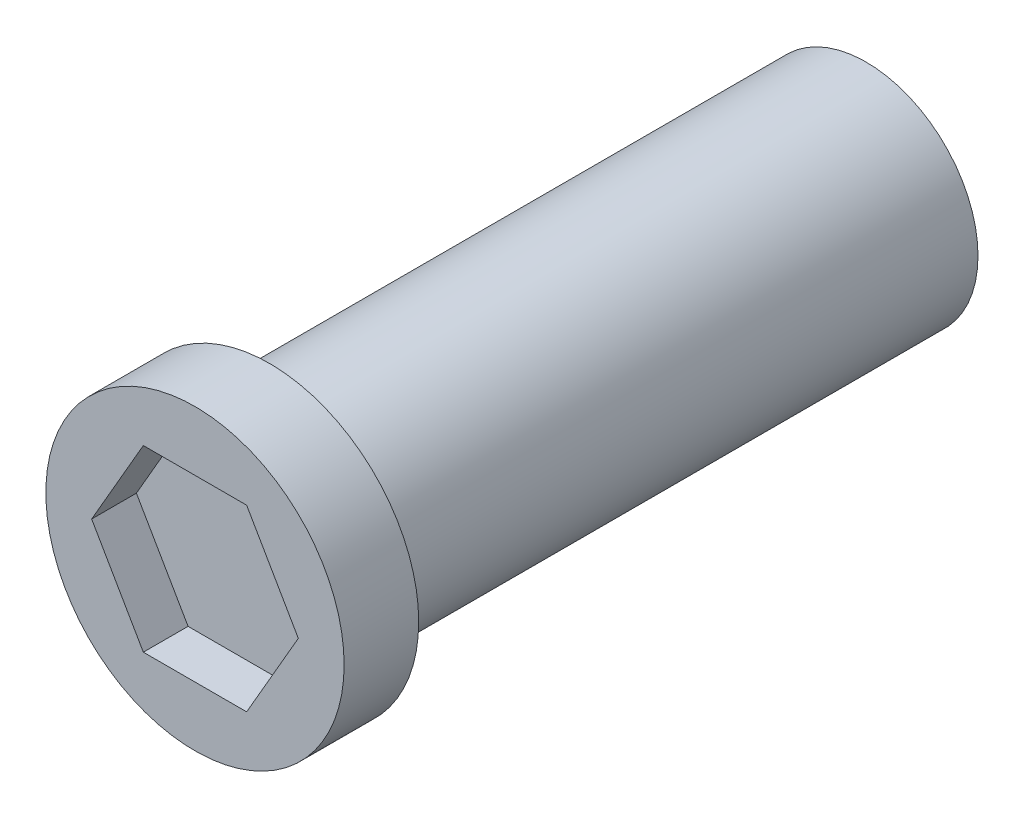
ISO-10303-21;
HEADER;
FILE_DESCRIPTION(('STEP AP214'),'2;1');
FILE_NAME('part.step','',(''),(''),'','','');
FILE_SCHEMA(('AUTOMOTIVE_DESIGN { 1 0 10303 214 1 1 1 1 }'));
ENDSEC;
DATA;
#1=APPLICATION_CONTEXT('core data for automotive mechanical design processes');
#2=APPLICATION_PROTOCOL_DEFINITION('international standard','automotive_design',2000,#1);
#3=PRODUCT_CONTEXT('',#1,'mechanical');
#4=PRODUCT('Part','Part','',(#3));
#5=PRODUCT_RELATED_PRODUCT_CATEGORY('part','',(#4));
#6=PRODUCT_DEFINITION_FORMATION('','',#4);
#7=PRODUCT_DEFINITION_CONTEXT('part definition',#1,'design');
#8=PRODUCT_DEFINITION('design','',#6,#7);
#9=PRODUCT_DEFINITION_SHAPE('','',#8);
#10=(LENGTH_UNIT() NAMED_UNIT(*) SI_UNIT(.MILLI.,.METRE.));
#11=(NAMED_UNIT(*) PLANE_ANGLE_UNIT() SI_UNIT($,.RADIAN.));
#12=(NAMED_UNIT(*) SI_UNIT($,.STERADIAN.) SOLID_ANGLE_UNIT());
#13=UNCERTAINTY_MEASURE_WITH_UNIT(LENGTH_MEASURE(1.E-05),#10,'distance_accuracy_value','');
#14=(GEOMETRIC_REPRESENTATION_CONTEXT(3) GLOBAL_UNCERTAINTY_ASSIGNED_CONTEXT((#13)) GLOBAL_UNIT_ASSIGNED_CONTEXT((#10,
#11,#12)) REPRESENTATION_CONTEXT('',''));
#15=CARTESIAN_POINT('',(0.,0.,0.));
#16=DIRECTION('',(0.,0.,1.));
#17=DIRECTION('',(1.,0.,0.));
#18=AXIS2_PLACEMENT_3D('',#15,#16,#17);
#19=CARTESIAN_POINT('',(0.,0.,40.));
#20=DIRECTION('',(0.,0.,-1.));
#21=DIRECTION('',(-1.,0.,0.));
#22=AXIS2_PLACEMENT_3D('',#19,#20,#21);
#23=CYLINDRICAL_SURFACE('',#22,7.5);
#24=CARTESIAN_POINT('',(0.,0.,40.));
#25=DIRECTION('',(0.,0.,1.));
#26=DIRECTION('',(1.,0.,0.));
#27=AXIS2_PLACEMENT_3D('',#24,#25,#26);
#28=CIRCLE('',#27,7.5);
#29=CARTESIAN_POINT('',(7.5,0.,40.));
#30=VERTEX_POINT('',#29);
#31=EDGE_CURVE('E11',#30,#30,#28,.T.);
#32=ORIENTED_EDGE('',*,*,#31,.F.);
#33=EDGE_LOOP('',(#32));
#34=FACE_BOUND('',#33,.T.);
#35=CARTESIAN_POINT('',(0.,0.,0.));
#36=DIRECTION('',(0.,0.,1.));
#37=DIRECTION('',(1.,0.,0.));
#38=AXIS2_PLACEMENT_3D('',#35,#36,#37);
#39=CIRCLE('',#38,7.5);
#40=CARTESIAN_POINT('',(7.5,0.,0.));
#41=VERTEX_POINT('',#40);
#42=EDGE_CURVE('E46',#41,#41,#39,.T.);
#43=ORIENTED_EDGE('',*,*,#42,.T.);
#44=EDGE_LOOP('',(#43));
#45=FACE_BOUND('',#44,.T.);
#46=ADVANCED_FACE('F43',(#34,#45),#23,.T.);
#47=CARTESIAN_POINT('',(0.,0.,0.));
#48=DIRECTION('',(0.,0.,1.));
#49=DIRECTION('',(1.,0.,0.));
#50=AXIS2_PLACEMENT_3D('',#47,#48,#49);
#51=PLANE('',#50);
#52=ORIENTED_EDGE('',*,*,#42,.F.);
#53=EDGE_LOOP('',(#52));
#54=FACE_BOUND('',#53,.T.);
#55=ADVANCED_FACE('F193',(#54),#51,.F.);
#56=CARTESIAN_POINT('',(0.,0.,45.));
#57=DIRECTION('',(0.,0.,-1.));
#58=DIRECTION('',(-1.,0.,0.));
#59=AXIS2_PLACEMENT_3D('',#56,#57,#58);
#60=CYLINDRICAL_SURFACE('',#59,10.);
#61=CARTESIAN_POINT('',(0.,0.,45.));
#62=DIRECTION('',(0.,0.,1.));
#63=DIRECTION('',(1.,0.,0.));
#64=AXIS2_PLACEMENT_3D('',#61,#62,#63);
#65=CIRCLE('',#64,10.);
#66=CARTESIAN_POINT('',(10.,0.,45.));
#67=VERTEX_POINT('',#66);
#68=EDGE_CURVE('E167',#67,#67,#65,.T.);
#69=ORIENTED_EDGE('',*,*,#68,.F.);
#70=EDGE_LOOP('',(#69));
#71=FACE_BOUND('',#70,.T.);
#72=CARTESIAN_POINT('',(0.,0.,40.));
#73=DIRECTION('',(0.,0.,1.));
#74=DIRECTION('',(1.,0.,0.));
#75=AXIS2_PLACEMENT_3D('',#72,#73,#74);
#76=CIRCLE('',#75,10.);
#77=CARTESIAN_POINT('',(10.,0.,40.));
#78=VERTEX_POINT('',#77);
#79=EDGE_CURVE('E157',#78,#78,#76,.T.);
#80=ORIENTED_EDGE('',*,*,#79,.T.);
#81=EDGE_LOOP('',(#80));
#82=FACE_BOUND('',#81,.T.);
#83=ADVANCED_FACE('F175',(#71,#82),#60,.T.);
#84=CARTESIAN_POINT('',(0.,0.,45.));
#85=DIRECTION('',(0.,0.,1.));
#86=DIRECTION('',(1.,0.,0.));
#87=AXIS2_PLACEMENT_3D('',#84,#85,#86);
#88=PLANE('',#87);
#89=DIRECTION('',(-0.5,-0.866025403784439,0.));
#90=VECTOR('',#89,1.);
#91=CARTESIAN_POINT('',(-3.46410161513776,6.,45.));
#92=LINE('',#91,#90);
#93=CARTESIAN_POINT('',(-3.46410161513776,6.,45.));
#94=VERTEX_POINT('',#93);
#95=CARTESIAN_POINT('',(-6.92820323027551,0.,45.));
#96=VERTEX_POINT('',#95);
#97=EDGE_CURVE('E58',#94,#96,#92,.T.);
#98=ORIENTED_EDGE('',*,*,#97,.F.);
#99=DIRECTION('',(-1.,0.,0.));
#100=VECTOR('',#99,1.);
#101=CARTESIAN_POINT('',(3.46410161513775,6.,45.));
#102=LINE('',#101,#100);
#103=CARTESIAN_POINT('',(3.46410161513775,6.,45.));
#104=VERTEX_POINT('',#103);
#105=EDGE_CURVE('E151',#104,#94,#102,.T.);
#106=ORIENTED_EDGE('',*,*,#105,.F.);
#107=DIRECTION('',(-0.5,0.866025403784439,0.));
#108=VECTOR('',#107,1.);
#109=CARTESIAN_POINT('',(6.92820323027551,0.,45.));
#110=LINE('',#109,#108);
#111=CARTESIAN_POINT('',(6.92820323027551,0.,45.));
#112=VERTEX_POINT('',#111);
#113=EDGE_CURVE('E148',#112,#104,#110,.T.);
#114=ORIENTED_EDGE('',*,*,#113,.F.);
#115=DIRECTION('',(0.5,0.866025403784439,0.));
#116=VECTOR('',#115,1.);
#117=CARTESIAN_POINT('',(3.46410161513776,-6.,45.));
#118=LINE('',#117,#116);
#119=CARTESIAN_POINT('',(3.46410161513776,-6.,45.));
#120=VERTEX_POINT('',#119);
#121=EDGE_CURVE('E106',#120,#112,#118,.T.);
#122=ORIENTED_EDGE('',*,*,#121,.F.);
#123=DIRECTION('',(1.,0.,0.));
#124=VECTOR('',#123,1.);
#125=CARTESIAN_POINT('',(-3.46410161513775,-6.,45.));
#126=LINE('',#125,#124);
#127=CARTESIAN_POINT('',(-3.46410161513775,-6.,45.));
#128=VERTEX_POINT('',#127);
#129=EDGE_CURVE('E142',#128,#120,#126,.T.);
#130=ORIENTED_EDGE('',*,*,#129,.F.);
#131=DIRECTION('',(0.5,-0.866025403784438,0.));
#132=VECTOR('',#131,1.);
#133=CARTESIAN_POINT('',(-6.92820323027551,0.,45.));
#134=LINE('',#133,#132);
#135=EDGE_CURVE('E138',#96,#128,#134,.T.);
#136=ORIENTED_EDGE('',*,*,#135,.F.);
#137=EDGE_LOOP('',(#98,#106,#114,#122,#130,#136));
#138=FACE_BOUND('',#137,.T.);
#139=ORIENTED_EDGE('',*,*,#68,.T.);
#140=EDGE_LOOP('',(#139));
#141=FACE_BOUND('',#140,.T.);
#142=ADVANCED_FACE('F180',(#138,#141),#88,.T.);
#143=CARTESIAN_POINT('',(0.,0.,40.));
#144=DIRECTION('',(0.,0.,1.));
#145=DIRECTION('',(1.,0.,0.));
#146=AXIS2_PLACEMENT_3D('',#143,#144,#145);
#147=PLANE('',#146);
#148=ORIENTED_EDGE('',*,*,#31,.T.);
#149=EDGE_LOOP('',(#148));
#150=FACE_BOUND('',#149,.T.);
#151=ORIENTED_EDGE('',*,*,#79,.F.);
#152=EDGE_LOOP('',(#151));
#153=FACE_BOUND('',#152,.T.);
#154=ADVANCED_FACE('F177',(#150,#153),#147,.F.);
#155=CARTESIAN_POINT('',(-3.46410161513776,6.,42.));
#156=DIRECTION('',(-0.866025403784439,0.5,0.));
#157=DIRECTION('',(-0.5,-0.866025403784439,0.));
#158=AXIS2_PLACEMENT_3D('',#155,#156,#157);
#159=PLANE('',#158);
#160=ORIENTED_EDGE('',*,*,#97,.T.);
#161=DIRECTION('',(0.,0.,1.));
#162=VECTOR('',#161,1.);
#163=CARTESIAN_POINT('',(-6.92820323027551,0.,42.));
#164=LINE('',#163,#162);
#165=CARTESIAN_POINT('',(-6.92820323027551,0.,42.));
#166=VERTEX_POINT('',#165);
#167=EDGE_CURVE('E88',#166,#96,#164,.T.);
#168=ORIENTED_EDGE('',*,*,#167,.F.);
#169=DIRECTION('',(-0.5,-0.866025403784439,0.));
#170=VECTOR('',#169,1.);
#171=CARTESIAN_POINT('',(-3.46410161513776,6.,42.));
#172=LINE('',#171,#170);
#173=CARTESIAN_POINT('',(-3.46410161513776,6.,42.));
#174=VERTEX_POINT('',#173);
#175=EDGE_CURVE('E154',#174,#166,#172,.T.);
#176=ORIENTED_EDGE('',*,*,#175,.F.);
#177=DIRECTION('',(0.,0.,1.));
#178=VECTOR('',#177,1.);
#179=CARTESIAN_POINT('',(-3.46410161513776,6.,42.));
#180=LINE('',#179,#178);
#181=EDGE_CURVE('E66',#174,#94,#180,.T.);
#182=ORIENTED_EDGE('',*,*,#181,.T.);
#183=EDGE_LOOP('',(#160,#168,#176,#182));
#184=FACE_BOUND('',#183,.T.);
#185=ADVANCED_FACE('F179',(#184),#159,.F.);
#186=CARTESIAN_POINT('',(3.46410161513775,6.,42.));
#187=DIRECTION('',(0.,1.,0.));
#188=DIRECTION('',(-1.,0.,0.));
#189=AXIS2_PLACEMENT_3D('',#186,#187,#188);
#190=PLANE('',#189);
#191=ORIENTED_EDGE('',*,*,#105,.T.);
#192=ORIENTED_EDGE('',*,*,#181,.F.);
#193=DIRECTION('',(-1.,0.,0.));
#194=VECTOR('',#193,1.);
#195=CARTESIAN_POINT('',(3.46410161513775,6.,42.));
#196=LINE('',#195,#194);
#197=CARTESIAN_POINT('',(3.46410161513775,6.,42.));
#198=VERTEX_POINT('',#197);
#199=EDGE_CURVE('E120',#198,#174,#196,.T.);
#200=ORIENTED_EDGE('',*,*,#199,.F.);
#201=DIRECTION('',(0.,0.,1.));
#202=VECTOR('',#201,1.);
#203=CARTESIAN_POINT('',(3.46410161513775,6.,42.));
#204=LINE('',#203,#202);
#205=EDGE_CURVE('E111',#198,#104,#204,.T.);
#206=ORIENTED_EDGE('',*,*,#205,.T.);
#207=EDGE_LOOP('',(#191,#192,#200,#206));
#208=FACE_BOUND('',#207,.T.);
#209=ADVANCED_FACE('F187',(#208),#190,.F.);
#210=CARTESIAN_POINT('',(6.92820323027551,0.,42.));
#211=DIRECTION('',(0.866025403784439,0.5,0.));
#212=DIRECTION('',(-0.5,0.866025403784439,0.));
#213=AXIS2_PLACEMENT_3D('',#210,#211,#212);
#214=PLANE('',#213);
#215=ORIENTED_EDGE('',*,*,#113,.T.);
#216=ORIENTED_EDGE('',*,*,#205,.F.);
#217=DIRECTION('',(-0.5,0.866025403784439,0.));
#218=VECTOR('',#217,1.);
#219=CARTESIAN_POINT('',(6.92820323027551,0.,42.));
#220=LINE('',#219,#218);
#221=CARTESIAN_POINT('',(6.92820323027551,0.,42.));
#222=VERTEX_POINT('',#221);
#223=EDGE_CURVE('E115',#222,#198,#220,.T.);
#224=ORIENTED_EDGE('',*,*,#223,.F.);
#225=DIRECTION('',(0.,0.,1.));
#226=VECTOR('',#225,1.);
#227=CARTESIAN_POINT('',(6.92820323027551,0.,42.));
#228=LINE('',#227,#226);
#229=EDGE_CURVE('E99',#222,#112,#228,.T.);
#230=ORIENTED_EDGE('',*,*,#229,.T.);
#231=EDGE_LOOP('',(#215,#216,#224,#230));
#232=FACE_BOUND('',#231,.T.);
#233=ADVANCED_FACE('F116',(#232),#214,.F.);
#234=CARTESIAN_POINT('',(3.46410161513776,-6.,42.));
#235=DIRECTION('',(0.866025403784439,-0.5,0.));
#236=DIRECTION('',(0.5,0.866025403784439,0.));
#237=AXIS2_PLACEMENT_3D('',#234,#235,#236);
#238=PLANE('',#237);
#239=ORIENTED_EDGE('',*,*,#121,.T.);
#240=ORIENTED_EDGE('',*,*,#229,.F.);
#241=DIRECTION('',(0.5,0.866025403784439,0.));
#242=VECTOR('',#241,1.);
#243=CARTESIAN_POINT('',(3.46410161513776,-6.,42.));
#244=LINE('',#243,#242);
#245=CARTESIAN_POINT('',(3.46410161513776,-6.,42.));
#246=VERTEX_POINT('',#245);
#247=EDGE_CURVE('E103',#246,#222,#244,.T.);
#248=ORIENTED_EDGE('',*,*,#247,.F.);
#249=DIRECTION('',(0.,0.,1.));
#250=VECTOR('',#249,1.);
#251=CARTESIAN_POINT('',(3.46410161513776,-6.,42.));
#252=LINE('',#251,#250);
#253=EDGE_CURVE('E112',#246,#120,#252,.T.);
#254=ORIENTED_EDGE('',*,*,#253,.T.);
#255=EDGE_LOOP('',(#239,#240,#248,#254));
#256=FACE_BOUND('',#255,.T.);
#257=ADVANCED_FACE('F101',(#256),#238,.F.);
#258=CARTESIAN_POINT('',(-3.46410161513775,-6.,42.));
#259=DIRECTION('',(0.,-1.,0.));
#260=DIRECTION('',(0.,0.,-1.));
#261=AXIS2_PLACEMENT_3D('',#258,#259,#260);
#262=PLANE('',#261);
#263=ORIENTED_EDGE('',*,*,#129,.T.);
#264=ORIENTED_EDGE('',*,*,#253,.F.);
#265=DIRECTION('',(1.,0.,0.));
#266=VECTOR('',#265,1.);
#267=CARTESIAN_POINT('',(-3.46410161513775,-6.,42.));
#268=LINE('',#267,#266);
#269=CARTESIAN_POINT('',(-3.46410161513775,-6.,42.));
#270=VERTEX_POINT('',#269);
#271=EDGE_CURVE('E126',#270,#246,#268,.T.);
#272=ORIENTED_EDGE('',*,*,#271,.F.);
#273=DIRECTION('',(0.,0.,1.));
#274=VECTOR('',#273,1.);
#275=CARTESIAN_POINT('',(-3.46410161513775,-6.,42.));
#276=LINE('',#275,#274);
#277=EDGE_CURVE('E162',#270,#128,#276,.T.);
#278=ORIENTED_EDGE('',*,*,#277,.T.);
#279=EDGE_LOOP('',(#263,#264,#272,#278));
#280=FACE_BOUND('',#279,.T.);
#281=ADVANCED_FACE('F253',(#280),#262,.F.);
#282=CARTESIAN_POINT('',(-6.92820323027551,0.,42.));
#283=DIRECTION('',(-0.866025403784439,-0.5,0.));
#284=DIRECTION('',(0.5,-0.866025403784439,0.));
#285=AXIS2_PLACEMENT_3D('',#282,#283,#284);
#286=PLANE('',#285);
#287=ORIENTED_EDGE('',*,*,#135,.T.);
#288=ORIENTED_EDGE('',*,*,#277,.F.);
#289=DIRECTION('',(0.5,-0.866025403784438,0.));
#290=VECTOR('',#289,1.);
#291=CARTESIAN_POINT('',(-6.92820323027551,0.,42.));
#292=LINE('',#291,#290);
#293=EDGE_CURVE('E130',#166,#270,#292,.T.);
#294=ORIENTED_EDGE('',*,*,#293,.F.);
#295=ORIENTED_EDGE('',*,*,#167,.T.);
#296=EDGE_LOOP('',(#287,#288,#294,#295));
#297=FACE_BOUND('',#296,.T.);
#298=ADVANCED_FACE('F263',(#297),#286,.F.);
#299=CARTESIAN_POINT('',(0.,0.,42.));
#300=DIRECTION('',(0.,0.,1.));
#301=DIRECTION('',(1.,0.,0.));
#302=AXIS2_PLACEMENT_3D('',#299,#300,#301);
#303=PLANE('',#302);
#304=ORIENTED_EDGE('',*,*,#175,.T.);
#305=ORIENTED_EDGE('',*,*,#293,.T.);
#306=ORIENTED_EDGE('',*,*,#271,.T.);
#307=ORIENTED_EDGE('',*,*,#247,.T.);
#308=ORIENTED_EDGE('',*,*,#223,.T.);
#309=ORIENTED_EDGE('',*,*,#199,.T.);
#310=EDGE_LOOP('',(#304,#305,#306,#307,#308,#309));
#311=FACE_BOUND('',#310,.T.);
#312=ADVANCED_FACE('F123',(#311),#303,.T.);
#313=CLOSED_SHELL('',(#46,#55,#83,#142,#154,#185,#209,#233,#257,#281,#298,#312));
#314=MANIFOLD_SOLID_BREP('B2',#313);
#315=ADVANCED_BREP_SHAPE_REPRESENTATION('',(#18,#314),#14);
#316=SHAPE_DEFINITION_REPRESENTATION(#9,#315);
ENDSEC;
END-ISO-10303-21;
